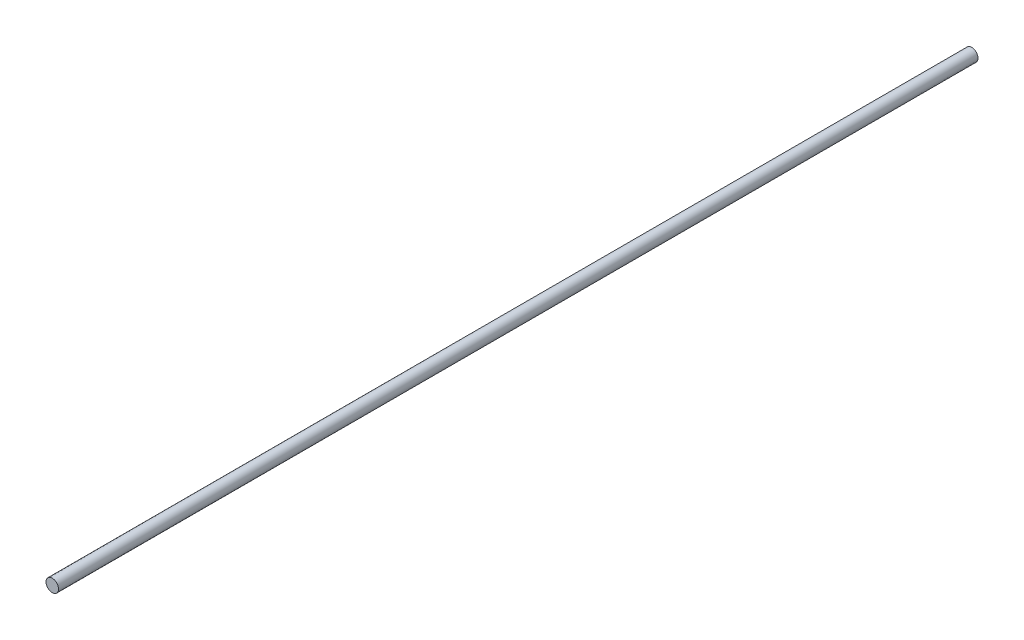
ISO-10303-21;
HEADER;
FILE_DESCRIPTION(('STEP AP214'),'2;1');
FILE_NAME('part.step','',(''),(''),'','','');
FILE_SCHEMA(('AUTOMOTIVE_DESIGN { 1 0 10303 214 1 1 1 1 }'));
ENDSEC;
DATA;
#1=APPLICATION_CONTEXT('core data for automotive mechanical design processes');
#2=APPLICATION_PROTOCOL_DEFINITION('international standard','automotive_design',2000,#1);
#3=PRODUCT_CONTEXT('',#1,'mechanical');
#4=PRODUCT('Part','Part','',(#3));
#5=PRODUCT_RELATED_PRODUCT_CATEGORY('part','',(#4));
#6=PRODUCT_DEFINITION_FORMATION('','',#4);
#7=PRODUCT_DEFINITION_CONTEXT('part definition',#1,'design');
#8=PRODUCT_DEFINITION('design','',#6,#7);
#9=PRODUCT_DEFINITION_SHAPE('','',#8);
#10=(LENGTH_UNIT() NAMED_UNIT(*) SI_UNIT(.MILLI.,.METRE.));
#11=(NAMED_UNIT(*) PLANE_ANGLE_UNIT() SI_UNIT($,.RADIAN.));
#12=(NAMED_UNIT(*) SI_UNIT($,.STERADIAN.) SOLID_ANGLE_UNIT());
#13=UNCERTAINTY_MEASURE_WITH_UNIT(LENGTH_MEASURE(1.E-05),#10,'distance_accuracy_value','');
#14=(GEOMETRIC_REPRESENTATION_CONTEXT(3) GLOBAL_UNCERTAINTY_ASSIGNED_CONTEXT((#13)) GLOBAL_UNIT_ASSIGNED_CONTEXT((#10,
#11,#12)) REPRESENTATION_CONTEXT('',''));
#15=CARTESIAN_POINT('',(0.,0.,0.));
#16=DIRECTION('',(0.,0.,1.));
#17=DIRECTION('',(1.,0.,0.));
#18=AXIS2_PLACEMENT_3D('',#15,#16,#17);
#19=CARTESIAN_POINT('',(0.,0.,220.));
#20=DIRECTION('',(0.,0.,-1.));
#21=DIRECTION('',(-1.,0.,0.));
#22=AXIS2_PLACEMENT_3D('',#19,#20,#21);
#23=CYLINDRICAL_SURFACE('',#22,1.5);
#24=CARTESIAN_POINT('',(0.,0.,220.));
#25=DIRECTION('',(0.,0.,1.));
#26=DIRECTION('',(1.,0.,0.));
#27=AXIS2_PLACEMENT_3D('',#24,#25,#26);
#28=CIRCLE('',#27,1.5);
#29=CARTESIAN_POINT('',(1.5,0.,220.));
#30=VERTEX_POINT('',#29);
#31=EDGE_CURVE('E10',#30,#30,#28,.T.);
#32=ORIENTED_EDGE('',*,*,#31,.F.);
#33=EDGE_LOOP('',(#32));
#34=FACE_BOUND('',#33,.T.);
#35=CARTESIAN_POINT('',(0.,0.,0.));
#36=DIRECTION('',(0.,0.,1.));
#37=DIRECTION('',(1.,0.,0.));
#38=AXIS2_PLACEMENT_3D('',#35,#36,#37);
#39=CIRCLE('',#38,1.5);
#40=CARTESIAN_POINT('',(1.5,0.,0.));
#41=VERTEX_POINT('',#40);
#42=EDGE_CURVE('E34',#41,#41,#39,.T.);
#43=ORIENTED_EDGE('',*,*,#42,.T.);
#44=EDGE_LOOP('',(#43));
#45=FACE_BOUND('',#44,.T.);
#46=ADVANCED_FACE('F31',(#34,#45),#23,.T.);
#47=CARTESIAN_POINT('',(0.,0.,220.));
#48=DIRECTION('',(0.,0.,1.));
#49=DIRECTION('',(1.,0.,0.));
#50=AXIS2_PLACEMENT_3D('',#47,#48,#49);
#51=PLANE('',#50);
#52=ORIENTED_EDGE('',*,*,#31,.T.);
#53=EDGE_LOOP('',(#52));
#54=FACE_BOUND('',#53,.T.);
#55=ADVANCED_FACE('F46',(#54),#51,.T.);
#56=CARTESIAN_POINT('',(0.,0.,0.));
#57=DIRECTION('',(0.,0.,1.));
#58=DIRECTION('',(1.,0.,0.));
#59=AXIS2_PLACEMENT_3D('',#56,#57,#58);
#60=PLANE('',#59);
#61=ORIENTED_EDGE('',*,*,#42,.F.);
#62=EDGE_LOOP('',(#61));
#63=FACE_BOUND('',#62,.T.);
#64=ADVANCED_FACE('F44',(#63),#60,.F.);
#65=CLOSED_SHELL('',(#46,#55,#64));
#66=MANIFOLD_SOLID_BREP('B2',#65);
#67=ADVANCED_BREP_SHAPE_REPRESENTATION('',(#18,#66),#14);
#68=SHAPE_DEFINITION_REPRESENTATION(#9,#67);
ENDSEC;
END-ISO-10303-21;
